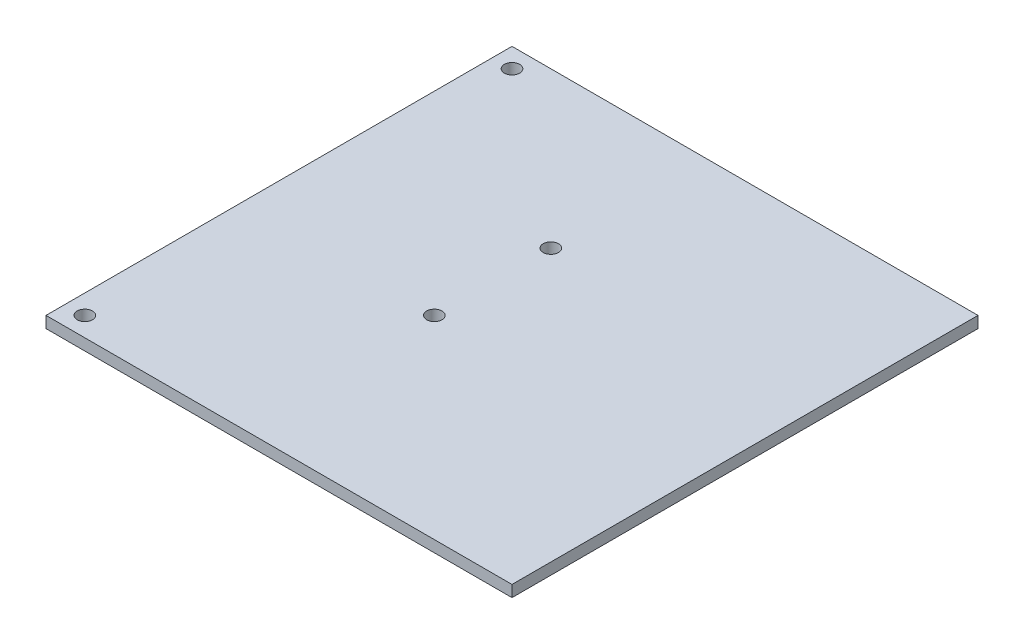
ISO-10303-21;
HEADER;
FILE_DESCRIPTION(('STEP AP214'),'2;1');
FILE_NAME('part.step','',(''),(''),'','','');
FILE_SCHEMA(('AUTOMOTIVE_DESIGN { 1 0 10303 214 1 1 1 1 }'));
ENDSEC;
DATA;
#1=APPLICATION_CONTEXT('core data for automotive mechanical design processes');
#2=APPLICATION_PROTOCOL_DEFINITION('international standard','automotive_design',2000,#1);
#3=PRODUCT_CONTEXT('',#1,'mechanical');
#4=PRODUCT('Part','Part','',(#3));
#5=PRODUCT_RELATED_PRODUCT_CATEGORY('part','',(#4));
#6=PRODUCT_DEFINITION_FORMATION('','',#4);
#7=PRODUCT_DEFINITION_CONTEXT('part definition',#1,'design');
#8=PRODUCT_DEFINITION('design','',#6,#7);
#9=PRODUCT_DEFINITION_SHAPE('','',#8);
#10=(LENGTH_UNIT() NAMED_UNIT(*) SI_UNIT(.MILLI.,.METRE.));
#11=(NAMED_UNIT(*) PLANE_ANGLE_UNIT() SI_UNIT($,.RADIAN.));
#12=(NAMED_UNIT(*) SI_UNIT($,.STERADIAN.) SOLID_ANGLE_UNIT());
#13=UNCERTAINTY_MEASURE_WITH_UNIT(LENGTH_MEASURE(1.E-05),#10,'distance_accuracy_value','');
#14=(GEOMETRIC_REPRESENTATION_CONTEXT(3) GLOBAL_UNCERTAINTY_ASSIGNED_CONTEXT((#13)) GLOBAL_UNIT_ASSIGNED_CONTEXT((#10,
#11,#12)) REPRESENTATION_CONTEXT('',''));
#15=CARTESIAN_POINT('',(0.,0.,0.));
#16=DIRECTION('',(0.,0.,1.));
#17=DIRECTION('',(1.,0.,0.));
#18=AXIS2_PLACEMENT_3D('',#15,#16,#17);
#19=CARTESIAN_POINT('',(0.,0.,0.));
#20=DIRECTION('',(0.,1.,0.));
#21=DIRECTION('',(0.,0.,1.));
#22=AXIS2_PLACEMENT_3D('',#19,#20,#21);
#23=PLANE('',#22);
#24=CARTESIAN_POINT('',(58.42,0.,-45.72));
#25=DIRECTION('',(0.,-1.,0.));
#26=DIRECTION('',(0.,0.,-1.));
#27=AXIS2_PLACEMENT_3D('',#24,#25,#26);
#28=CIRCLE('',#27,0.499999999999999);
#29=CARTESIAN_POINT('',(58.42,0.,-46.22));
#30=VERTEX_POINT('',#29);
#31=EDGE_CURVE('E152',#30,#30,#28,.T.);
#32=ORIENTED_EDGE('',*,*,#31,.F.);
#33=EDGE_LOOP('',(#32));
#34=FACE_BOUND('',#33,.T.);
#35=CARTESIAN_POINT('',(10.16,0.,-2.54));
#36=DIRECTION('',(0.,1.,0.));
#37=DIRECTION('',(0.,0.,1.));
#38=AXIS2_PLACEMENT_3D('',#35,#36,#37);
#39=CIRCLE('',#38,0.499999999999999);
#40=CARTESIAN_POINT('',(10.16,0.,-2.04));
#41=VERTEX_POINT('',#40);
#42=EDGE_CURVE('E140',#41,#41,#39,.T.);
#43=ORIENTED_EDGE('',*,*,#42,.T.);
#44=EDGE_LOOP('',(#43));
#45=FACE_BOUND('',#44,.T.);
#46=CARTESIAN_POINT('',(10.16,0.,-58.42));
#47=DIRECTION('',(0.,-1.,0.));
#48=DIRECTION('',(0.,0.,-1.));
#49=AXIS2_PLACEMENT_3D('',#46,#47,#48);
#50=CIRCLE('',#49,0.499999999999999);
#51=CARTESIAN_POINT('',(10.16,0.,-58.92));
#52=VERTEX_POINT('',#51);
#53=EDGE_CURVE('E137',#52,#52,#50,.T.);
#54=ORIENTED_EDGE('',*,*,#53,.F.);
#55=EDGE_LOOP('',(#54));
#56=FACE_BOUND('',#55,.T.);
#57=CARTESIAN_POINT('',(25.4,0.,-40.64));
#58=DIRECTION('',(0.,1.,0.));
#59=DIRECTION('',(0.,0.,1.));
#60=AXIS2_PLACEMENT_3D('',#57,#58,#59);
#61=CIRCLE('',#60,0.999999999999998);
#62=CARTESIAN_POINT('',(25.4,0.,-39.64));
#63=VERTEX_POINT('',#62);
#64=EDGE_CURVE('E104',#63,#63,#61,.T.);
#65=ORIENTED_EDGE('',*,*,#64,.T.);
#66=EDGE_LOOP('',(#65));
#67=FACE_BOUND('',#66,.T.);
#68=CARTESIAN_POINT('',(25.4,0.,-25.4));
#69=DIRECTION('',(0.,1.,0.));
#70=DIRECTION('',(0.,0.,1.));
#71=AXIS2_PLACEMENT_3D('',#68,#69,#70);
#72=CIRCLE('',#71,0.999999999999998);
#73=CARTESIAN_POINT('',(25.4,0.,-24.4));
#74=VERTEX_POINT('',#73);
#75=EDGE_CURVE('E107',#74,#74,#72,.T.);
#76=ORIENTED_EDGE('',*,*,#75,.T.);
#77=EDGE_LOOP('',(#76));
#78=FACE_BOUND('',#77,.T.);
#79=DIRECTION('',(1.,0.,0.));
#80=VECTOR('',#79,1.);
#81=CARTESIAN_POINT('',(0.,0.,0.));
#82=LINE('',#81,#80);
#83=CARTESIAN_POINT('',(0.,0.,0.));
#84=VERTEX_POINT('',#83);
#85=CARTESIAN_POINT('',(60.96,0.,0.));
#86=VERTEX_POINT('',#85);
#87=EDGE_CURVE('E111',#84,#86,#82,.T.);
#88=ORIENTED_EDGE('',*,*,#87,.F.);
#89=DIRECTION('',(0.,0.,-1.));
#90=VECTOR('',#89,1.);
#91=CARTESIAN_POINT('',(0.,0.,0.));
#92=LINE('',#91,#90);
#93=CARTESIAN_POINT('',(0.,0.,-60.96));
#94=VERTEX_POINT('',#93);
#95=EDGE_CURVE('E116',#84,#94,#92,.T.);
#96=ORIENTED_EDGE('',*,*,#95,.T.);
#97=DIRECTION('',(1.,0.,0.));
#98=VECTOR('',#97,1.);
#99=CARTESIAN_POINT('',(0.,0.,-60.96));
#100=LINE('',#99,#98);
#101=CARTESIAN_POINT('',(60.96,0.,-60.96));
#102=VERTEX_POINT('',#101);
#103=EDGE_CURVE('E114',#94,#102,#100,.T.);
#104=ORIENTED_EDGE('',*,*,#103,.T.);
#105=DIRECTION('',(0.,0.,-1.));
#106=VECTOR('',#105,1.);
#107=CARTESIAN_POINT('',(60.96,0.,0.));
#108=LINE('',#107,#106);
#109=EDGE_CURVE('E89',#86,#102,#108,.T.);
#110=ORIENTED_EDGE('',*,*,#109,.F.);
#111=EDGE_LOOP('',(#88,#96,#104,#110));
#112=FACE_BOUND('',#111,.T.);
#113=CARTESIAN_POINT('',(2.54,0.,-2.54));
#114=DIRECTION('',(0.,1.,0.));
#115=DIRECTION('',(0.,0.,1.));
#116=AXIS2_PLACEMENT_3D('',#113,#114,#115);
#117=CIRCLE('',#116,0.999999999999998);
#118=CARTESIAN_POINT('',(2.54,0.,-1.54));
#119=VERTEX_POINT('',#118);
#120=EDGE_CURVE('E119',#119,#119,#117,.T.);
#121=ORIENTED_EDGE('',*,*,#120,.T.);
#122=EDGE_LOOP('',(#121));
#123=FACE_BOUND('',#122,.T.);
#124=CARTESIAN_POINT('',(2.54,0.,-58.42));
#125=DIRECTION('',(0.,1.,0.));
#126=DIRECTION('',(0.,0.,1.));
#127=AXIS2_PLACEMENT_3D('',#124,#125,#126);
#128=CIRCLE('',#127,0.999999999999999);
#129=CARTESIAN_POINT('',(2.54,0.,-57.42));
#130=VERTEX_POINT('',#129);
#131=EDGE_CURVE('E122',#130,#130,#128,.F.);
#132=ORIENTED_EDGE('',*,*,#131,.F.);
#133=EDGE_LOOP('',(#132));
#134=FACE_BOUND('',#133,.T.);
#135=CARTESIAN_POINT('',(58.42,0.,-15.24));
#136=DIRECTION('',(0.,1.,0.));
#137=DIRECTION('',(0.,0.,1.));
#138=AXIS2_PLACEMENT_3D('',#135,#136,#137);
#139=CIRCLE('',#138,0.499999999999999);
#140=CARTESIAN_POINT('',(58.42,0.,-14.74));
#141=VERTEX_POINT('',#140);
#142=EDGE_CURVE('E146',#141,#141,#139,.T.);
#143=ORIENTED_EDGE('',*,*,#142,.T.);
#144=EDGE_LOOP('',(#143));
#145=FACE_BOUND('',#144,.T.);
#146=ADVANCED_FACE('F33',(#34,#45,#56,#67,#78,#112,#123,#134,#145),#23,.F.);
#147=CARTESIAN_POINT('',(0.,1.5,0.));
#148=DIRECTION('',(0.,0.,-1.));
#149=DIRECTION('',(-1.,0.,0.));
#150=AXIS2_PLACEMENT_3D('',#147,#148,#149);
#151=PLANE('',#150);
#152=ORIENTED_EDGE('',*,*,#87,.T.);
#153=DIRECTION('',(0.,-1.,0.));
#154=VECTOR('',#153,1.);
#155=CARTESIAN_POINT('',(60.96,1.5,0.));
#156=LINE('',#155,#154);
#157=CARTESIAN_POINT('',(60.96,1.5,0.));
#158=VERTEX_POINT('',#157);
#159=EDGE_CURVE('E11',#158,#86,#156,.T.);
#160=ORIENTED_EDGE('',*,*,#159,.F.);
#161=DIRECTION('',(1.,0.,0.));
#162=VECTOR('',#161,1.);
#163=CARTESIAN_POINT('',(0.,1.5,0.));
#164=LINE('',#163,#162);
#165=CARTESIAN_POINT('',(0.,1.5,0.));
#166=VERTEX_POINT('',#165);
#167=EDGE_CURVE('E84',#166,#158,#164,.T.);
#168=ORIENTED_EDGE('',*,*,#167,.F.);
#169=DIRECTION('',(0.,-1.,0.));
#170=VECTOR('',#169,1.);
#171=CARTESIAN_POINT('',(0.,1.5,0.));
#172=LINE('',#171,#170);
#173=EDGE_CURVE('E50',#166,#84,#172,.T.);
#174=ORIENTED_EDGE('',*,*,#173,.T.);
#175=EDGE_LOOP('',(#152,#160,#168,#174));
#176=FACE_BOUND('',#175,.T.);
#177=ADVANCED_FACE('F165',(#176),#151,.F.);
#178=CARTESIAN_POINT('',(60.96,1.5,0.));
#179=DIRECTION('',(-1.,0.,0.));
#180=DIRECTION('',(0.,0.,1.));
#181=AXIS2_PLACEMENT_3D('',#178,#179,#180);
#182=PLANE('',#181);
#183=ORIENTED_EDGE('',*,*,#109,.T.);
#184=DIRECTION('',(0.,-1.,0.));
#185=VECTOR('',#184,1.);
#186=CARTESIAN_POINT('',(60.96,1.5,-60.96));
#187=LINE('',#186,#185);
#188=CARTESIAN_POINT('',(60.96,1.5,-60.96));
#189=VERTEX_POINT('',#188);
#190=EDGE_CURVE('E42',#189,#102,#187,.T.);
#191=ORIENTED_EDGE('',*,*,#190,.F.);
#192=DIRECTION('',(0.,0.,-1.));
#193=VECTOR('',#192,1.);
#194=CARTESIAN_POINT('',(60.96,1.5,0.));
#195=LINE('',#194,#193);
#196=EDGE_CURVE('E75',#158,#189,#195,.T.);
#197=ORIENTED_EDGE('',*,*,#196,.F.);
#198=ORIENTED_EDGE('',*,*,#159,.T.);
#199=EDGE_LOOP('',(#183,#191,#197,#198));
#200=FACE_BOUND('',#199,.T.);
#201=ADVANCED_FACE('F88',(#200),#182,.F.);
#202=CARTESIAN_POINT('',(0.,1.5,-60.96));
#203=DIRECTION('',(0.,0.,-1.));
#204=DIRECTION('',(-1.,0.,0.));
#205=AXIS2_PLACEMENT_3D('',#202,#203,#204);
#206=PLANE('',#205);
#207=ORIENTED_EDGE('',*,*,#103,.F.);
#208=DIRECTION('',(0.,-1.,0.));
#209=VECTOR('',#208,1.);
#210=CARTESIAN_POINT('',(0.,1.5,-60.96));
#211=LINE('',#210,#209);
#212=CARTESIAN_POINT('',(0.,1.5,-60.96));
#213=VERTEX_POINT('',#212);
#214=EDGE_CURVE('E64',#213,#94,#211,.T.);
#215=ORIENTED_EDGE('',*,*,#214,.F.);
#216=DIRECTION('',(1.,0.,0.));
#217=VECTOR('',#216,1.);
#218=CARTESIAN_POINT('',(0.,1.5,-60.96));
#219=LINE('',#218,#217);
#220=EDGE_CURVE('E83',#213,#189,#219,.T.);
#221=ORIENTED_EDGE('',*,*,#220,.T.);
#222=ORIENTED_EDGE('',*,*,#190,.T.);
#223=EDGE_LOOP('',(#207,#215,#221,#222));
#224=FACE_BOUND('',#223,.T.);
#225=ADVANCED_FACE('F92',(#224),#206,.T.);
#226=CARTESIAN_POINT('',(2.54,1.5,-2.54));
#227=DIRECTION('',(0.,-1.,0.));
#228=DIRECTION('',(0.,0.,-1.));
#229=AXIS2_PLACEMENT_3D('',#226,#227,#228);
#230=CYLINDRICAL_SURFACE('',#229,0.999999999999998);
#231=CARTESIAN_POINT('',(2.54,1.5,-2.54));
#232=DIRECTION('',(0.,1.,0.));
#233=DIRECTION('',(0.,0.,1.));
#234=AXIS2_PLACEMENT_3D('',#231,#232,#233);
#235=CIRCLE('',#234,0.999999999999998);
#236=CARTESIAN_POINT('',(2.54,1.5,-1.54));
#237=VERTEX_POINT('',#236);
#238=EDGE_CURVE('E95',#237,#237,#235,.T.);
#239=ORIENTED_EDGE('',*,*,#238,.T.);
#240=EDGE_LOOP('',(#239));
#241=FACE_BOUND('',#240,.T.);
#242=ORIENTED_EDGE('',*,*,#120,.F.);
#243=EDGE_LOOP('',(#242));
#244=FACE_BOUND('',#243,.T.);
#245=ADVANCED_FACE('F218',(#241,#244),#230,.F.);
#246=CARTESIAN_POINT('',(0.,1.5,0.));
#247=DIRECTION('',(-1.,0.,0.));
#248=DIRECTION('',(0.,0.,1.));
#249=AXIS2_PLACEMENT_3D('',#246,#247,#248);
#250=PLANE('',#249);
#251=ORIENTED_EDGE('',*,*,#95,.F.);
#252=ORIENTED_EDGE('',*,*,#173,.F.);
#253=DIRECTION('',(0.,0.,-1.));
#254=VECTOR('',#253,1.);
#255=CARTESIAN_POINT('',(0.,1.5,0.));
#256=LINE('',#255,#254);
#257=EDGE_CURVE('E93',#166,#213,#256,.T.);
#258=ORIENTED_EDGE('',*,*,#257,.T.);
#259=ORIENTED_EDGE('',*,*,#214,.T.);
#260=EDGE_LOOP('',(#251,#252,#258,#259));
#261=FACE_BOUND('',#260,.T.);
#262=ADVANCED_FACE('F221',(#261),#250,.T.);
#263=CARTESIAN_POINT('',(25.4,1.5,-25.4));
#264=DIRECTION('',(0.,-1.,0.));
#265=DIRECTION('',(0.,0.,-1.));
#266=AXIS2_PLACEMENT_3D('',#263,#264,#265);
#267=CYLINDRICAL_SURFACE('',#266,0.999999999999998);
#268=CARTESIAN_POINT('',(25.4,1.5,-25.4));
#269=DIRECTION('',(0.,1.,0.));
#270=DIRECTION('',(0.,0.,1.));
#271=AXIS2_PLACEMENT_3D('',#268,#269,#270);
#272=CIRCLE('',#271,0.999999999999998);
#273=CARTESIAN_POINT('',(25.4,1.5,-24.4));
#274=VERTEX_POINT('',#273);
#275=EDGE_CURVE('E130',#274,#274,#272,.T.);
#276=ORIENTED_EDGE('',*,*,#275,.T.);
#277=EDGE_LOOP('',(#276));
#278=FACE_BOUND('',#277,.T.);
#279=ORIENTED_EDGE('',*,*,#75,.F.);
#280=EDGE_LOOP('',(#279));
#281=FACE_BOUND('',#280,.T.);
#282=ADVANCED_FACE('F225',(#278,#281),#267,.F.);
#283=CARTESIAN_POINT('',(25.4,1.5,-40.64));
#284=DIRECTION('',(0.,-1.,0.));
#285=DIRECTION('',(0.,0.,-1.));
#286=AXIS2_PLACEMENT_3D('',#283,#284,#285);
#287=CYLINDRICAL_SURFACE('',#286,0.999999999999998);
#288=CARTESIAN_POINT('',(25.4,1.5,-40.64));
#289=DIRECTION('',(0.,1.,0.));
#290=DIRECTION('',(0.,0.,1.));
#291=AXIS2_PLACEMENT_3D('',#288,#289,#290);
#292=CIRCLE('',#291,0.999999999999998);
#293=CARTESIAN_POINT('',(25.4,1.5,-39.64));
#294=VERTEX_POINT('',#293);
#295=EDGE_CURVE('E125',#294,#294,#292,.T.);
#296=ORIENTED_EDGE('',*,*,#295,.T.);
#297=EDGE_LOOP('',(#296));
#298=FACE_BOUND('',#297,.T.);
#299=ORIENTED_EDGE('',*,*,#64,.F.);
#300=EDGE_LOOP('',(#299));
#301=FACE_BOUND('',#300,.T.);
#302=ADVANCED_FACE('F35',(#298,#301),#287,.F.);
#303=CARTESIAN_POINT('',(2.54,1.5,-58.42));
#304=DIRECTION('',(0.,-1.,0.));
#305=DIRECTION('',(0.,0.,-1.));
#306=AXIS2_PLACEMENT_3D('',#303,#304,#305);
#307=CYLINDRICAL_SURFACE('',#306,0.999999999999999);
#308=CARTESIAN_POINT('',(2.54,1.5,-58.42));
#309=DIRECTION('',(0.,1.,0.));
#310=DIRECTION('',(0.,0.,1.));
#311=AXIS2_PLACEMENT_3D('',#308,#309,#310);
#312=CIRCLE('',#311,0.999999999999999);
#313=CARTESIAN_POINT('',(2.54,1.5,-57.42));
#314=VERTEX_POINT('',#313);
#315=EDGE_CURVE('E101',#314,#314,#312,.F.);
#316=ORIENTED_EDGE('',*,*,#315,.F.);
#317=EDGE_LOOP('',(#316));
#318=FACE_BOUND('',#317,.T.);
#319=ORIENTED_EDGE('',*,*,#131,.T.);
#320=EDGE_LOOP('',(#319));
#321=FACE_BOUND('',#320,.T.);
#322=ADVANCED_FACE('F212',(#318,#321),#307,.F.);
#323=CARTESIAN_POINT('',(0.,1.5,0.));
#324=DIRECTION('',(0.,1.,0.));
#325=DIRECTION('',(0.,0.,1.));
#326=AXIS2_PLACEMENT_3D('',#323,#324,#325);
#327=PLANE('',#326);
#328=ORIENTED_EDGE('',*,*,#295,.F.);
#329=EDGE_LOOP('',(#328));
#330=FACE_BOUND('',#329,.T.);
#331=ORIENTED_EDGE('',*,*,#275,.F.);
#332=EDGE_LOOP('',(#331));
#333=FACE_BOUND('',#332,.T.);
#334=ORIENTED_EDGE('',*,*,#167,.T.);
#335=ORIENTED_EDGE('',*,*,#196,.T.);
#336=ORIENTED_EDGE('',*,*,#220,.F.);
#337=ORIENTED_EDGE('',*,*,#257,.F.);
#338=EDGE_LOOP('',(#334,#335,#336,#337));
#339=FACE_BOUND('',#338,.T.);
#340=ORIENTED_EDGE('',*,*,#238,.F.);
#341=EDGE_LOOP('',(#340));
#342=FACE_BOUND('',#341,.T.);
#343=ORIENTED_EDGE('',*,*,#315,.T.);
#344=EDGE_LOOP('',(#343));
#345=FACE_BOUND('',#344,.T.);
#346=ADVANCED_FACE('F79',(#330,#333,#339,#342,#345),#327,.T.);
#347=CARTESIAN_POINT('',(10.16,0.75,-58.42));
#348=DIRECTION('',(0.,-1.,0.));
#349=DIRECTION('',(0.,0.,-1.));
#350=AXIS2_PLACEMENT_3D('',#347,#348,#349);
#351=CYLINDRICAL_SURFACE('',#350,0.499999999999999);
#352=CARTESIAN_POINT('',(10.16,0.75,-58.42));
#353=DIRECTION('',(0.,-1.,0.));
#354=DIRECTION('',(0.,0.,-1.));
#355=AXIS2_PLACEMENT_3D('',#352,#353,#354);
#356=CIRCLE('',#355,0.499999999999999);
#357=CARTESIAN_POINT('',(10.16,0.75,-58.92));
#358=VERTEX_POINT('',#357);
#359=EDGE_CURVE('E108',#358,#358,#356,.T.);
#360=ORIENTED_EDGE('',*,*,#359,.F.);
#361=EDGE_LOOP('',(#360));
#362=FACE_BOUND('',#361,.T.);
#363=ORIENTED_EDGE('',*,*,#53,.T.);
#364=EDGE_LOOP('',(#363));
#365=FACE_BOUND('',#364,.T.);
#366=ADVANCED_FACE('F206',(#362,#365),#351,.F.);
#367=CARTESIAN_POINT('',(10.16,0.75,-58.42));
#368=DIRECTION('',(0.,-1.,0.));
#369=DIRECTION('',(0.,0.,-1.));
#370=AXIS2_PLACEMENT_3D('',#367,#368,#369);
#371=PLANE('',#370);
#372=ORIENTED_EDGE('',*,*,#359,.T.);
#373=EDGE_LOOP('',(#372));
#374=FACE_BOUND('',#373,.T.);
#375=ADVANCED_FACE('F201',(#374),#371,.T.);
#376=CARTESIAN_POINT('',(10.16,0.75,-2.54));
#377=DIRECTION('',(0.,-1.,0.));
#378=DIRECTION('',(0.,0.,-1.));
#379=AXIS2_PLACEMENT_3D('',#376,#377,#378);
#380=CYLINDRICAL_SURFACE('',#379,0.499999999999999);
#381=CARTESIAN_POINT('',(10.16,0.75,-2.54));
#382=DIRECTION('',(0.,1.,0.));
#383=DIRECTION('',(0.,0.,1.));
#384=AXIS2_PLACEMENT_3D('',#381,#382,#383);
#385=CIRCLE('',#384,0.499999999999999);
#386=CARTESIAN_POINT('',(10.16,0.75,-2.04));
#387=VERTEX_POINT('',#386);
#388=EDGE_CURVE('E143',#387,#387,#385,.T.);
#389=ORIENTED_EDGE('',*,*,#388,.T.);
#390=EDGE_LOOP('',(#389));
#391=FACE_BOUND('',#390,.T.);
#392=ORIENTED_EDGE('',*,*,#42,.F.);
#393=EDGE_LOOP('',(#392));
#394=FACE_BOUND('',#393,.T.);
#395=ADVANCED_FACE('F193',(#391,#394),#380,.F.);
#396=CARTESIAN_POINT('',(10.16,0.75,-2.54));
#397=DIRECTION('',(0.,1.,0.));
#398=DIRECTION('',(0.,0.,1.));
#399=AXIS2_PLACEMENT_3D('',#396,#397,#398);
#400=PLANE('',#399);
#401=ORIENTED_EDGE('',*,*,#388,.F.);
#402=EDGE_LOOP('',(#401));
#403=FACE_BOUND('',#402,.T.);
#404=ADVANCED_FACE('F184',(#403),#400,.F.);
#405=CARTESIAN_POINT('',(58.42,0.75,-15.24));
#406=DIRECTION('',(0.,-1.,0.));
#407=DIRECTION('',(0.,0.,-1.));
#408=AXIS2_PLACEMENT_3D('',#405,#406,#407);
#409=CYLINDRICAL_SURFACE('',#408,0.499999999999999);
#410=CARTESIAN_POINT('',(58.42,0.75,-15.24));
#411=DIRECTION('',(0.,1.,0.));
#412=DIRECTION('',(0.,0.,1.));
#413=AXIS2_PLACEMENT_3D('',#410,#411,#412);
#414=CIRCLE('',#413,0.499999999999999);
#415=CARTESIAN_POINT('',(58.42,0.75,-14.74));
#416=VERTEX_POINT('',#415);
#417=EDGE_CURVE('E149',#416,#416,#414,.T.);
#418=ORIENTED_EDGE('',*,*,#417,.T.);
#419=EDGE_LOOP('',(#418));
#420=FACE_BOUND('',#419,.T.);
#421=ORIENTED_EDGE('',*,*,#142,.F.);
#422=EDGE_LOOP('',(#421));
#423=FACE_BOUND('',#422,.T.);
#424=ADVANCED_FACE('F181',(#420,#423),#409,.F.);
#425=CARTESIAN_POINT('',(58.42,0.75,-15.24));
#426=DIRECTION('',(0.,1.,0.));
#427=DIRECTION('',(0.,0.,1.));
#428=AXIS2_PLACEMENT_3D('',#425,#426,#427);
#429=PLANE('',#428);
#430=ORIENTED_EDGE('',*,*,#417,.F.);
#431=EDGE_LOOP('',(#430));
#432=FACE_BOUND('',#431,.T.);
#433=ADVANCED_FACE('F183',(#432),#429,.F.);
#434=CARTESIAN_POINT('',(58.42,0.75,-45.72));
#435=DIRECTION('',(0.,-1.,0.));
#436=DIRECTION('',(0.,0.,-1.));
#437=AXIS2_PLACEMENT_3D('',#434,#435,#436);
#438=CYLINDRICAL_SURFACE('',#437,0.499999999999999);
#439=CARTESIAN_POINT('',(58.42,0.75,-45.72));
#440=DIRECTION('',(0.,-1.,0.));
#441=DIRECTION('',(0.,0.,-1.));
#442=AXIS2_PLACEMENT_3D('',#439,#440,#441);
#443=CIRCLE('',#442,0.499999999999999);
#444=CARTESIAN_POINT('',(58.42,0.75,-46.22));
#445=VERTEX_POINT('',#444);
#446=EDGE_CURVE('E155',#445,#445,#443,.T.);
#447=ORIENTED_EDGE('',*,*,#446,.F.);
#448=EDGE_LOOP('',(#447));
#449=FACE_BOUND('',#448,.T.);
#450=ORIENTED_EDGE('',*,*,#31,.T.);
#451=EDGE_LOOP('',(#450));
#452=FACE_BOUND('',#451,.T.);
#453=ADVANCED_FACE('F161',(#449,#452),#438,.F.);
#454=CARTESIAN_POINT('',(58.42,0.75,-45.72));
#455=DIRECTION('',(0.,-1.,0.));
#456=DIRECTION('',(0.,0.,-1.));
#457=AXIS2_PLACEMENT_3D('',#454,#455,#456);
#458=PLANE('',#457);
#459=ORIENTED_EDGE('',*,*,#446,.T.);
#460=EDGE_LOOP('',(#459));
#461=FACE_BOUND('',#460,.T.);
#462=ADVANCED_FACE('F197',(#461),#458,.T.);
#463=CLOSED_SHELL('',(#146,#177,#201,#225,#245,#262,#282,#302,#322,#346,#366,#375,#395,#404,
#424,#433,#453,#462));
#464=MANIFOLD_SOLID_BREP('B2',#463);
#465=ADVANCED_BREP_SHAPE_REPRESENTATION('',(#18,#464),#14);
#466=SHAPE_DEFINITION_REPRESENTATION(#9,#465);
ENDSEC;
END-ISO-10303-21;
